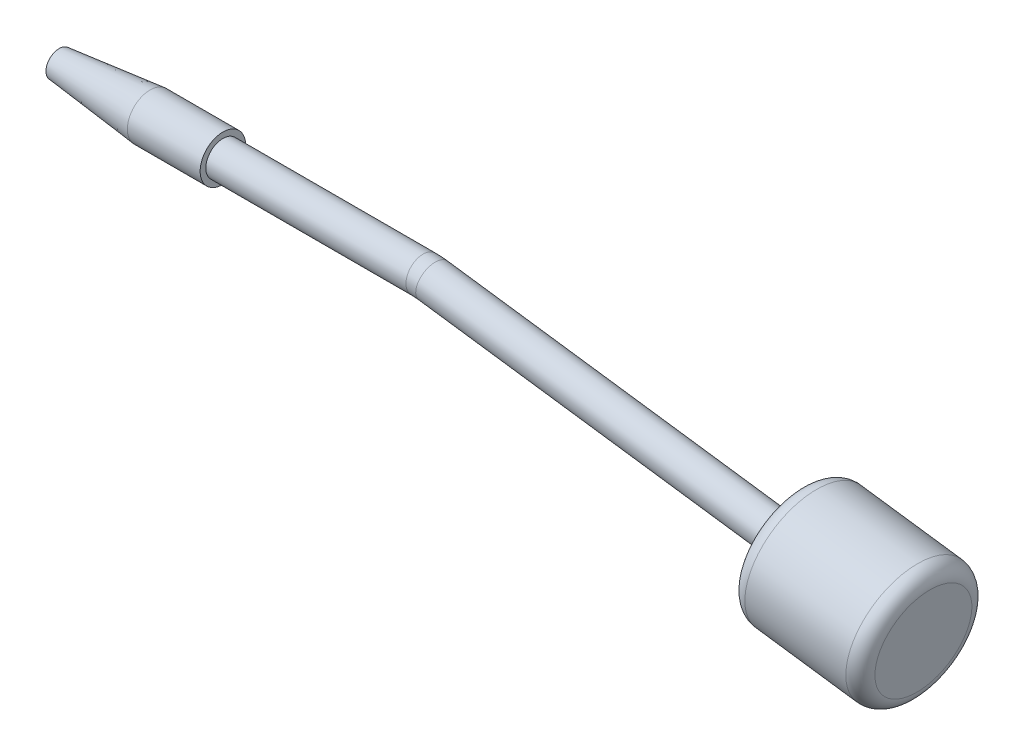
ISO-10303-21;
HEADER;
FILE_DESCRIPTION(('STEP AP214'),'2;1');
FILE_NAME('part.step','',(''),(''),'','','');
FILE_SCHEMA(('AUTOMOTIVE_DESIGN { 1 0 10303 214 1 1 1 1 }'));
ENDSEC;
DATA;
#1=APPLICATION_CONTEXT('core data for automotive mechanical design processes');
#2=APPLICATION_PROTOCOL_DEFINITION('international standard','automotive_design',2000,#1);
#3=PRODUCT_CONTEXT('',#1,'mechanical');
#4=PRODUCT('Part','Part','',(#3));
#5=PRODUCT_RELATED_PRODUCT_CATEGORY('part','',(#4));
#6=PRODUCT_DEFINITION_FORMATION('','',#4);
#7=PRODUCT_DEFINITION_CONTEXT('part definition',#1,'design');
#8=PRODUCT_DEFINITION('design','',#6,#7);
#9=PRODUCT_DEFINITION_SHAPE('','',#8);
#10=(LENGTH_UNIT() NAMED_UNIT(*) SI_UNIT(.MILLI.,.METRE.));
#11=(NAMED_UNIT(*) PLANE_ANGLE_UNIT() SI_UNIT($,.RADIAN.));
#12=(NAMED_UNIT(*) SI_UNIT($,.STERADIAN.) SOLID_ANGLE_UNIT());
#13=UNCERTAINTY_MEASURE_WITH_UNIT(LENGTH_MEASURE(1.E-05),#10,'distance_accuracy_value','');
#14=(GEOMETRIC_REPRESENTATION_CONTEXT(3) GLOBAL_UNCERTAINTY_ASSIGNED_CONTEXT((#13)) GLOBAL_UNIT_ASSIGNED_CONTEXT((#10,
#11,#12)) REPRESENTATION_CONTEXT('',''));
#15=CARTESIAN_POINT('',(0.,0.,0.));
#16=DIRECTION('',(0.,0.,1.));
#17=DIRECTION('',(1.,0.,0.));
#18=AXIS2_PLACEMENT_3D('',#15,#16,#17);
#19=CARTESIAN_POINT('',(0.,0.,0.));
#20=DIRECTION('',(1.,0.,0.));
#21=DIRECTION('',(0.,1.,0.));
#22=AXIS2_PLACEMENT_3D('',#19,#20,#21);
#23=CYLINDRICAL_SURFACE('',#22,3.96875);
#24=CARTESIAN_POINT('',(-34.925,0.,0.));
#25=DIRECTION('',(1.,0.,0.));
#26=DIRECTION('',(0.,1.,0.));
#27=AXIS2_PLACEMENT_3D('',#24,#25,#26);
#28=CIRCLE('',#27,3.96875);
#29=CARTESIAN_POINT('',(-34.925,3.96874999999999,0.));
#30=VERTEX_POINT('',#29);
#31=EDGE_CURVE('E63',#30,#30,#28,.T.);
#32=ORIENTED_EDGE('',*,*,#31,.F.);
#33=EDGE_LOOP('',(#32));
#34=FACE_BOUND('',#33,.T.);
#35=CARTESIAN_POINT('',(-47.625,0.,0.));
#36=DIRECTION('',(1.,0.,0.));
#37=DIRECTION('',(0.,1.,0.));
#38=AXIS2_PLACEMENT_3D('',#35,#36,#37);
#39=CIRCLE('',#38,3.96875);
#40=CARTESIAN_POINT('',(-47.625,3.96874999999999,0.));
#41=VERTEX_POINT('',#40);
#42=EDGE_CURVE('E76',#41,#41,#39,.T.);
#43=ORIENTED_EDGE('',*,*,#42,.T.);
#44=EDGE_LOOP('',(#43));
#45=FACE_BOUND('',#44,.T.);
#46=ADVANCED_FACE('F43',(#34,#45),#23,.T.);
#47=CARTESIAN_POINT('',(-34.925,-3.96875,0.));
#48=DIRECTION('',(-1.,0.,0.));
#49=DIRECTION('',(0.,-1.,0.));
#50=AXIS2_PLACEMENT_3D('',#47,#48,#49);
#51=PLANE('',#50);
#52=CARTESIAN_POINT('',(-34.925,0.,0.));
#53=DIRECTION('',(1.,0.,0.));
#54=DIRECTION('',(0.,1.,0.));
#55=AXIS2_PLACEMENT_3D('',#52,#53,#54);
#56=CIRCLE('',#55,2.98450000000002);
#57=CARTESIAN_POINT('',(-34.925,2.98450000000001,0.));
#58=VERTEX_POINT('',#57);
#59=EDGE_CURVE('E66',#58,#58,#56,.T.);
#60=ORIENTED_EDGE('',*,*,#59,.F.);
#61=EDGE_LOOP('',(#60));
#62=FACE_BOUND('',#61,.T.);
#63=ORIENTED_EDGE('',*,*,#31,.T.);
#64=EDGE_LOOP('',(#63));
#65=FACE_BOUND('',#64,.T.);
#66=ADVANCED_FACE('F112',(#62,#65),#51,.F.);
#67=CARTESIAN_POINT('',(0.,0.,0.));
#68=DIRECTION('',(1.,0.,0.));
#69=DIRECTION('',(0.,1.,0.));
#70=AXIS2_PLACEMENT_3D('',#67,#68,#69);
#71=CYLINDRICAL_SURFACE('',#70,2.98450000000002);
#72=CARTESIAN_POINT('',(0.,0.,0.));
#73=DIRECTION('',(1.,0.,0.));
#74=DIRECTION('',(0.,1.,0.));
#75=AXIS2_PLACEMENT_3D('',#72,#73,#74);
#76=CIRCLE('',#75,2.98450000000002);
#77=CARTESIAN_POINT('',(0.,2.9845,0.));
#78=VERTEX_POINT('',#77);
#79=EDGE_CURVE('E69',#78,#78,#76,.T.);
#80=ORIENTED_EDGE('',*,*,#79,.F.);
#81=EDGE_LOOP('',(#80));
#82=FACE_BOUND('',#81,.T.);
#83=ORIENTED_EDGE('',*,*,#59,.T.);
#84=EDGE_LOOP('',(#83));
#85=FACE_BOUND('',#84,.T.);
#86=ADVANCED_FACE('F118',(#82,#85),#71,.T.);
#87=CARTESIAN_POINT('',(0.,0.,0.));
#88=DIRECTION('',(1.,0.,0.));
#89=DIRECTION('',(0.,1.,0.));
#90=AXIS2_PLACEMENT_3D('',#87,#88,#89);
#91=CYLINDRICAL_SURFACE('',#90,0.793750000000017);
#92=CARTESIAN_POINT('',(-63.5,0.,0.));
#93=DIRECTION('',(1.,0.,0.));
#94=DIRECTION('',(0.,1.,0.));
#95=AXIS2_PLACEMENT_3D('',#92,#93,#94);
#96=CIRCLE('',#95,0.793750000000017);
#97=CARTESIAN_POINT('',(-63.5,0.793750000000009,0.));
#98=VERTEX_POINT('',#97);
#99=EDGE_CURVE('E72',#98,#98,#96,.T.);
#100=ORIENTED_EDGE('',*,*,#99,.F.);
#101=EDGE_LOOP('',(#100));
#102=FACE_BOUND('',#101,.T.);
#103=CARTESIAN_POINT('',(0.,0.,0.));
#104=DIRECTION('',(1.,0.,0.));
#105=DIRECTION('',(0.,1.,0.));
#106=AXIS2_PLACEMENT_3D('',#103,#104,#105);
#107=CIRCLE('',#106,0.793750000000018);
#108=CARTESIAN_POINT('',(0.,0.793750000000018,0.));
#109=VERTEX_POINT('',#108);
#110=EDGE_CURVE('E73',#109,#109,#107,.T.);
#111=ORIENTED_EDGE('',*,*,#110,.T.);
#112=EDGE_LOOP('',(#111));
#113=FACE_BOUND('',#112,.T.);
#114=ADVANCED_FACE('F200',(#102,#113),#91,.F.);
#115=CARTESIAN_POINT('',(-63.5,-0.793750000000025,0.));
#116=DIRECTION('',(1.,0.,0.));
#117=DIRECTION('',(0.,1.,0.));
#118=AXIS2_PLACEMENT_3D('',#115,#116,#117);
#119=PLANE('',#118);
#120=CARTESIAN_POINT('',(-63.5,0.,0.));
#121=DIRECTION('',(1.,0.,0.));
#122=DIRECTION('',(0.,1.,0.));
#123=AXIS2_PLACEMENT_3D('',#120,#121,#122);
#124=CIRCLE('',#123,2.286);
#125=CARTESIAN_POINT('',(-63.5,2.28599999999999,0.));
#126=VERTEX_POINT('',#125);
#127=EDGE_CURVE('E80',#126,#126,#124,.T.);
#128=ORIENTED_EDGE('',*,*,#127,.F.);
#129=EDGE_LOOP('',(#128));
#130=FACE_BOUND('',#129,.T.);
#131=ORIENTED_EDGE('',*,*,#99,.T.);
#132=EDGE_LOOP('',(#131));
#133=FACE_BOUND('',#132,.T.);
#134=ADVANCED_FACE('F191',(#130,#133),#119,.F.);
#135=CARTESIAN_POINT('',(-63.5,0.,0.));
#136=DIRECTION('',(1.,0.,0.));
#137=DIRECTION('',(0.,1.,0.));
#138=AXIS2_PLACEMENT_3D('',#135,#136,#137);
#139=CONICAL_SURFACE('',#138,2.286,0.1056056498234);
#140=ORIENTED_EDGE('',*,*,#42,.F.);
#141=EDGE_LOOP('',(#140));
#142=FACE_BOUND('',#141,.T.);
#143=ORIENTED_EDGE('',*,*,#127,.T.);
#144=EDGE_LOOP('',(#143));
#145=FACE_BOUND('',#144,.T.);
#146=ADVANCED_FACE('F109',(#142,#145),#139,.T.);
#147=CARTESIAN_POINT('',(0.,0.,0.));
#148=DIRECTION('',(-1.,0.,0.));
#149=DIRECTION('',(0.,-1.,0.));
#150=AXIS2_PLACEMENT_3D('',#147,#148,#149);
#151=PLANE('',#150);
#152=ORIENTED_EDGE('',*,*,#110,.F.);
#153=EDGE_LOOP('',(#152));
#154=FACE_BOUND('',#153,.T.);
#155=ADVANCED_FACE('F99',(#154),#151,.T.);
#156=CARTESIAN_POINT('',(0.,-12.7,0.));
#157=DIRECTION('',(0.,0.,-1.));
#158=DIRECTION('',(-1.,0.,0.));
#159=AXIS2_PLACEMENT_3D('',#156,#157,#158);
#160=TOROIDAL_SURFACE('',#159,12.7,2.9845);
#161=CARTESIAN_POINT('',(1.72358776991566,-0.117502426012672,0.));
#162=DIRECTION('',(-0.990747840471443,0.135715572434305,0.));
#163=DIRECTION('',(-0.135715572434305,-0.990747840471443,0.));
#164=AXIS2_PLACEMENT_3D('',#161,#162,#163);
#165=CIRCLE('',#164,2.9845);
#166=CARTESIAN_POINT('',(2.12863089584584,2.83938450387436,0.));
#167=VERTEX_POINT('',#166);
#168=EDGE_CURVE('E77',#167,#167,#165,.T.);
#169=CARTESIAN_POINT('',(0.,-12.7,0.));
#170=DIRECTION('',(0.,0.,-1.));
#171=DIRECTION('',(-1.,0.,0.));
#172=AXIS2_PLACEMENT_3D('',#169,#170,#171);
#173=CIRCLE('',#172,15.6845);
#174=EDGE_CURVE('',#78,#167,#173,.T.);
#175=ORIENTED_EDGE('',*,*,#79,.T.);
#176=ORIENTED_EDGE('',*,*,#168,.T.);
#177=ORIENTED_EDGE('',*,*,#174,.T.);
#178=ORIENTED_EDGE('',*,*,#174,.F.);
#179=EDGE_LOOP('',(#175,#177,#176,#178));
#180=FACE_BOUND('',#179,.T.);
#181=ADVANCED_FACE('F91',(#180),#160,.T.);
#182=CARTESIAN_POINT('',(1.72358776991567,-0.11750242601267,0.));
#183=DIRECTION('',(0.990747840471443,-0.135715572434305,0.));
#184=DIRECTION('',(0.135715572434305,0.990747840471444,0.));
#185=AXIS2_PLACEMENT_3D('',#182,#183,#184);
#186=CYLINDRICAL_SURFACE('',#185,2.9845);
#187=CARTESIAN_POINT('',(64.6360756398523,-8.73544127559105,0.));
#188=DIRECTION('',(-0.990747840471443,0.135715572434305,0.));
#189=DIRECTION('',(-0.135715572434305,-0.990747840471443,0.));
#190=AXIS2_PLACEMENT_3D('',#187,#188,#189);
#191=CIRCLE('',#190,2.9845);
#192=CARTESIAN_POINT('',(64.2310325139221,-11.6923282054781,0.));
#193=VERTEX_POINT('',#192);
#194=EDGE_CURVE('E85',#193,#193,#191,.T.);
#195=ORIENTED_EDGE('',*,*,#194,.T.);
#196=EDGE_LOOP('',(#195));
#197=FACE_BOUND('',#196,.T.);
#198=ORIENTED_EDGE('',*,*,#168,.F.);
#199=EDGE_LOOP('',(#198));
#200=FACE_BOUND('',#199,.T.);
#201=ADVANCED_FACE('F94',(#197,#200),#186,.T.);
#202=CARTESIAN_POINT('',(87.2845712730295,-11.8378992614393,0.));
#203=DIRECTION('',(0.990747840471443,-0.135715572434305,0.));
#204=DIRECTION('',(0.135715572434305,0.990747840471443,0.));
#205=AXIS2_PLACEMENT_3D('',#202,#203,#204);
#206=PLANE('',#205);
#207=CARTESIAN_POINT('',(87.2845712730295,-11.8378992614393,0.));
#208=DIRECTION('',(0.990747840471443,-0.135715572434305,0.));
#209=DIRECTION('',(0.135715572434305,0.990747840471443,0.));
#210=AXIS2_PLACEMENT_3D('',#207,#208,#209);
#211=CIRCLE('',#210,8.382);
#212=CARTESIAN_POINT('',(88.4221392011739,-3.53345086260763,0.));
#213=VERTEX_POINT('',#212);
#214=EDGE_CURVE('E50',#213,#213,#211,.T.);
#215=ORIENTED_EDGE('',*,*,#214,.T.);
#216=EDGE_LOOP('',(#215));
#217=FACE_BOUND('',#216,.T.);
#218=ADVANCED_FACE('F96',(#217),#206,.T.);
#219=CARTESIAN_POINT('',(64.6360756398523,-8.73544127559105,0.));
#220=DIRECTION('',(-0.990747840471443,0.135715572434305,0.));
#221=DIRECTION('',(-0.135715572434305,-0.990747840471443,0.));
#222=AXIS2_PLACEMENT_3D('',#219,#220,#221);
#223=CYLINDRICAL_SURFACE('',#222,10.922);
#224=CARTESIAN_POINT('',(84.7680717582321,-11.4931817074561,0.));
#225=DIRECTION('',(0.990747840471443,-0.135715572434305,0.));
#226=DIRECTION('',(0.135715572434305,0.990747840471443,0.));
#227=AXIS2_PLACEMENT_3D('',#224,#225,#226);
#228=CIRCLE('',#227,10.922);
#229=CARTESIAN_POINT('',(86.2503572403595,-0.672233793827028,0.));
#230=VERTEX_POINT('',#229);
#231=EDGE_CURVE('E54',#230,#230,#228,.F.);
#232=ORIENTED_EDGE('',*,*,#231,.T.);
#233=EDGE_LOOP('',(#232));
#234=FACE_BOUND('',#233,.T.);
#235=CARTESIAN_POINT('',(67.1525751546498,-9.08015882957418,0.));
#236=DIRECTION('',(-0.990747840471443,0.135715572434305,0.));
#237=DIRECTION('',(-0.135715572434305,-0.990747840471443,0.));
#238=AXIS2_PLACEMENT_3D('',#235,#236,#237);
#239=CIRCLE('',#238,10.922);
#240=CARTESIAN_POINT('',(65.6702896725223,-19.9011067432033,0.));
#241=VERTEX_POINT('',#240);
#242=EDGE_CURVE('E58',#241,#241,#239,.F.);
#243=ORIENTED_EDGE('',*,*,#242,.T.);
#244=EDGE_LOOP('',(#243));
#245=FACE_BOUND('',#244,.T.);
#246=ADVANCED_FACE('F104',(#234,#245),#223,.T.);
#247=CARTESIAN_POINT('',(63.1537901577248,-19.5563891892202,0.));
#248=DIRECTION('',(-0.990747840471443,0.135715572434305,0.));
#249=DIRECTION('',(-0.135715572434305,-0.990747840471443,0.));
#250=AXIS2_PLACEMENT_3D('',#247,#248,#249);
#251=PLANE('',#250);
#252=CARTESIAN_POINT('',(64.6360756398523,-8.73544127559105,0.));
#253=DIRECTION('',(-0.990747840471443,0.135715572434305,0.));
#254=DIRECTION('',(-0.135715572434305,-0.990747840471443,0.));
#255=AXIS2_PLACEMENT_3D('',#252,#253,#254);
#256=CIRCLE('',#255,8.382);
#257=CARTESIAN_POINT('',(63.498507711708,-17.0398896744227,0.));
#258=VERTEX_POINT('',#257);
#259=EDGE_CURVE('E11',#258,#258,#256,.T.);
#260=ORIENTED_EDGE('',*,*,#259,.T.);
#261=EDGE_LOOP('',(#260));
#262=FACE_BOUND('',#261,.T.);
#263=ORIENTED_EDGE('',*,*,#194,.F.);
#264=EDGE_LOOP('',(#263));
#265=FACE_BOUND('',#264,.T.);
#266=ADVANCED_FACE('F126',(#262,#265),#251,.T.);
#267=CARTESIAN_POINT('',(84.7680717582321,-11.4931817074561,0.));
#268=DIRECTION('',(0.990747840471443,-0.135715572434305,0.));
#269=DIRECTION('',(0.135715572434305,0.990747840471443,0.));
#270=AXIS2_PLACEMENT_3D('',#267,#268,#269);
#271=TOROIDAL_SURFACE('',#270,8.382,2.54);
#272=ORIENTED_EDGE('',*,*,#214,.F.);
#273=EDGE_LOOP('',(#272));
#274=FACE_BOUND('',#273,.T.);
#275=ORIENTED_EDGE('',*,*,#231,.F.);
#276=EDGE_LOOP('',(#275));
#277=FACE_BOUND('',#276,.T.);
#278=ADVANCED_FACE('F124',(#274,#277),#271,.T.);
#279=CARTESIAN_POINT('',(67.1525751546498,-9.08015882957418,0.));
#280=DIRECTION('',(-0.990747840471443,0.135715572434305,0.));
#281=DIRECTION('',(-0.135715572434305,-0.990747840471443,0.));
#282=AXIS2_PLACEMENT_3D('',#279,#280,#281);
#283=TOROIDAL_SURFACE('',#282,8.382,2.54);
#284=ORIENTED_EDGE('',*,*,#242,.F.);
#285=EDGE_LOOP('',(#284));
#286=FACE_BOUND('',#285,.T.);
#287=ORIENTED_EDGE('',*,*,#259,.F.);
#288=EDGE_LOOP('',(#287));
#289=FACE_BOUND('',#288,.T.);
#290=ADVANCED_FACE('F45',(#286,#289),#283,.T.);
#291=CLOSED_SHELL('',(#46,#66,#86,#114,#134,#146,#155,#181,#201,#218,#246,#266,#278,#290));
#292=MANIFOLD_SOLID_BREP('B2',#291);
#293=ADVANCED_BREP_SHAPE_REPRESENTATION('',(#18,#292),#14);
#294=SHAPE_DEFINITION_REPRESENTATION(#9,#293);
ENDSEC;
END-ISO-10303-21;
